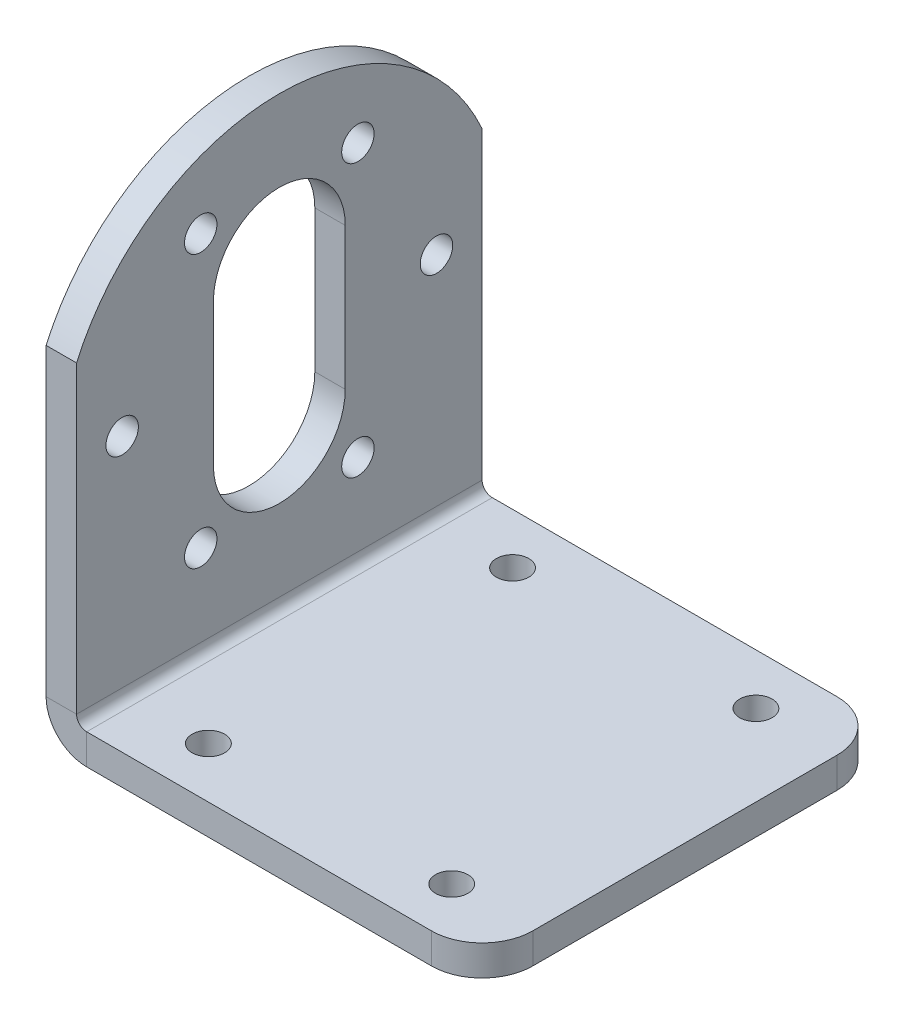
ISO-10303-21;
HEADER;
FILE_DESCRIPTION(('STEP AP214'),'2;1');
FILE_NAME('part.step','',(''),(''),'','','');
FILE_SCHEMA(('AUTOMOTIVE_DESIGN { 1 0 10303 214 1 1 1 1 }'));
ENDSEC;
DATA;
#1=APPLICATION_CONTEXT('core data for automotive mechanical design processes');
#2=APPLICATION_PROTOCOL_DEFINITION('international standard','automotive_design',2000,#1);
#3=PRODUCT_CONTEXT('',#1,'mechanical');
#4=PRODUCT('Part','Part','',(#3));
#5=PRODUCT_RELATED_PRODUCT_CATEGORY('part','',(#4));
#6=PRODUCT_DEFINITION_FORMATION('','',#4);
#7=PRODUCT_DEFINITION_CONTEXT('part definition',#1,'design');
#8=PRODUCT_DEFINITION('design','',#6,#7);
#9=PRODUCT_DEFINITION_SHAPE('','',#8);
#10=(LENGTH_UNIT() NAMED_UNIT(*) SI_UNIT(.MILLI.,.METRE.));
#11=(NAMED_UNIT(*) PLANE_ANGLE_UNIT() SI_UNIT($,.RADIAN.));
#12=(NAMED_UNIT(*) SI_UNIT($,.STERADIAN.) SOLID_ANGLE_UNIT());
#13=UNCERTAINTY_MEASURE_WITH_UNIT(LENGTH_MEASURE(1.E-05),#10,'distance_accuracy_value','');
#14=(GEOMETRIC_REPRESENTATION_CONTEXT(3) GLOBAL_UNCERTAINTY_ASSIGNED_CONTEXT((#13)) GLOBAL_UNIT_ASSIGNED_CONTEXT((#10,
#11,#12)) REPRESENTATION_CONTEXT('',''));
#15=CARTESIAN_POINT('',(0.,0.,0.));
#16=DIRECTION('',(0.,0.,1.));
#17=DIRECTION('',(1.,0.,0.));
#18=AXIS2_PLACEMENT_3D('',#15,#16,#17);
#19=CARTESIAN_POINT('',(7.99999999999999,44.,5.));
#20=DIRECTION('',(0.,-1.,0.));
#21=DIRECTION('',(0.,0.,-1.));
#22=AXIS2_PLACEMENT_3D('',#19,#20,#21);
#23=CYLINDRICAL_SURFACE('',#22,1.6);
#24=CARTESIAN_POINT('',(7.99999999999999,0.,5.));
#25=DIRECTION('',(0.,1.,0.));
#26=DIRECTION('',(0.,0.,1.));
#27=AXIS2_PLACEMENT_3D('',#24,#25,#26);
#28=CIRCLE('',#27,1.6);
#29=CARTESIAN_POINT('',(7.99999999999999,0.,6.6));
#30=VERTEX_POINT('',#29);
#31=EDGE_CURVE('E277',#30,#30,#28,.T.);
#32=ORIENTED_EDGE('',*,*,#31,.T.);
#33=EDGE_LOOP('',(#32));
#34=FACE_BOUND('',#33,.T.);
#35=CARTESIAN_POINT('',(7.99999999999999,-3.,5.));
#36=DIRECTION('',(0.,-1.,0.));
#37=DIRECTION('',(0.,0.,-1.));
#38=AXIS2_PLACEMENT_3D('',#35,#36,#37);
#39=CIRCLE('',#38,1.6);
#40=CARTESIAN_POINT('',(7.99999999999999,-3.,3.40000000000001));
#41=VERTEX_POINT('',#40);
#42=EDGE_CURVE('E280',#41,#41,#39,.T.);
#43=ORIENTED_EDGE('',*,*,#42,.T.);
#44=EDGE_LOOP('',(#43));
#45=FACE_BOUND('',#44,.T.);
#46=ADVANCED_FACE('F56',(#34,#45),#23,.F.);
#47=CARTESIAN_POINT('',(7.99999999999999,44.,35.));
#48=DIRECTION('',(0.,-1.,0.));
#49=DIRECTION('',(0.,0.,-1.));
#50=AXIS2_PLACEMENT_3D('',#47,#48,#49);
#51=CYLINDRICAL_SURFACE('',#50,1.6);
#52=CARTESIAN_POINT('',(7.99999999999999,0.,35.));
#53=DIRECTION('',(0.,1.,0.));
#54=DIRECTION('',(0.,0.,1.));
#55=AXIS2_PLACEMENT_3D('',#52,#53,#54);
#56=CIRCLE('',#55,1.6);
#57=CARTESIAN_POINT('',(7.99999999999999,0.,36.6));
#58=VERTEX_POINT('',#57);
#59=EDGE_CURVE('E266',#58,#58,#56,.T.);
#60=ORIENTED_EDGE('',*,*,#59,.T.);
#61=EDGE_LOOP('',(#60));
#62=FACE_BOUND('',#61,.T.);
#63=CARTESIAN_POINT('',(7.99999999999999,-3.,35.));
#64=DIRECTION('',(0.,-1.,0.));
#65=DIRECTION('',(0.,0.,-1.));
#66=AXIS2_PLACEMENT_3D('',#63,#64,#65);
#67=CIRCLE('',#66,1.6);
#68=CARTESIAN_POINT('',(7.99999999999999,-3.,33.4));
#69=VERTEX_POINT('',#68);
#70=EDGE_CURVE('E274',#69,#69,#67,.T.);
#71=ORIENTED_EDGE('',*,*,#70,.T.);
#72=EDGE_LOOP('',(#71));
#73=FACE_BOUND('',#72,.T.);
#74=ADVANCED_FACE('F362',(#62,#73),#51,.F.);
#75=CARTESIAN_POINT('',(0.,0.,40.));
#76=DIRECTION('',(1.,0.,0.));
#77=DIRECTION('',(0.,0.,-1.));
#78=AXIS2_PLACEMENT_3D('',#75,#76,#77);
#79=PLANE('',#78);
#80=CARTESIAN_POINT('',(0.,22.5,4.5));
#81=DIRECTION('',(1.,0.,0.));
#82=DIRECTION('',(0.,0.,-1.));
#83=AXIS2_PLACEMENT_3D('',#80,#81,#82);
#84=CIRCLE('',#83,1.6);
#85=CARTESIAN_POINT('',(0.,22.5,2.9));
#86=VERTEX_POINT('',#85);
#87=EDGE_CURVE('E679',#86,#86,#84,.T.);
#88=ORIENTED_EDGE('',*,*,#87,.F.);
#89=EDGE_LOOP('',(#88));
#90=FACE_BOUND('',#89,.T.);
#91=CARTESIAN_POINT('',(0.,35.9233937586588,12.25));
#92=DIRECTION('',(1.,0.,0.));
#93=DIRECTION('',(0.,0.,-1.));
#94=AXIS2_PLACEMENT_3D('',#91,#92,#93);
#95=CIRCLE('',#94,1.59999999999995);
#96=CARTESIAN_POINT('',(0.,35.9233937586588,10.6500000000001));
#97=VERTEX_POINT('',#96);
#98=EDGE_CURVE('E683',#97,#97,#95,.T.);
#99=ORIENTED_EDGE('',*,*,#98,.F.);
#100=EDGE_LOOP('',(#99));
#101=FACE_BOUND('',#100,.T.);
#102=CARTESIAN_POINT('',(0.,35.9233937586589,27.7499999999999));
#103=DIRECTION('',(1.,0.,0.));
#104=DIRECTION('',(0.,0.,-1.));
#105=AXIS2_PLACEMENT_3D('',#102,#103,#104);
#106=CIRCLE('',#105,1.6);
#107=CARTESIAN_POINT('',(0.,35.9233937586589,26.1499999999999));
#108=VERTEX_POINT('',#107);
#109=EDGE_CURVE('E687',#108,#108,#106,.T.);
#110=ORIENTED_EDGE('',*,*,#109,.F.);
#111=EDGE_LOOP('',(#110));
#112=FACE_BOUND('',#111,.T.);
#113=CARTESIAN_POINT('',(0.,22.5000000000001,35.5));
#114=DIRECTION('',(1.,0.,0.));
#115=DIRECTION('',(0.,0.,-1.));
#116=AXIS2_PLACEMENT_3D('',#113,#114,#115);
#117=CIRCLE('',#116,1.6);
#118=CARTESIAN_POINT('',(0.,22.5000000000001,33.9));
#119=VERTEX_POINT('',#118);
#120=EDGE_CURVE('E691',#119,#119,#117,.T.);
#121=ORIENTED_EDGE('',*,*,#120,.F.);
#122=EDGE_LOOP('',(#121));
#123=FACE_BOUND('',#122,.T.);
#124=CARTESIAN_POINT('',(0.,9.07660624134124,27.7500000000001));
#125=DIRECTION('',(1.,0.,0.));
#126=DIRECTION('',(0.,0.,-1.));
#127=AXIS2_PLACEMENT_3D('',#124,#125,#126);
#128=CIRCLE('',#127,1.6);
#129=CARTESIAN_POINT('',(0.,9.07660624134124,26.1500000000001));
#130=VERTEX_POINT('',#129);
#131=EDGE_CURVE('E695',#130,#130,#128,.T.);
#132=ORIENTED_EDGE('',*,*,#131,.F.);
#133=EDGE_LOOP('',(#132));
#134=FACE_BOUND('',#133,.T.);
#135=CARTESIAN_POINT('',(0.,9.07660624134118,12.25));
#136=DIRECTION('',(1.,0.,0.));
#137=DIRECTION('',(0.,0.,-1.));
#138=AXIS2_PLACEMENT_3D('',#135,#136,#137);
#139=CIRCLE('',#138,1.6);
#140=CARTESIAN_POINT('',(0.,9.07660624134118,10.65));
#141=VERTEX_POINT('',#140);
#142=EDGE_CURVE('E699',#141,#141,#139,.T.);
#143=ORIENTED_EDGE('',*,*,#142,.F.);
#144=EDGE_LOOP('',(#143));
#145=FACE_BOUND('',#144,.T.);
#146=CARTESIAN_POINT('',(0.,29.5,20.));
#147=DIRECTION('',(1.,0.,0.));
#148=DIRECTION('',(0.,0.,-1.));
#149=AXIS2_PLACEMENT_3D('',#146,#147,#148);
#150=CIRCLE('',#149,6.5);
#151=CARTESIAN_POINT('',(0.,29.5,13.5));
#152=VERTEX_POINT('',#151);
#153=CARTESIAN_POINT('',(0.,29.5,26.5));
#154=VERTEX_POINT('',#153);
#155=EDGE_CURVE('E199',#152,#154,#150,.T.);
#156=ORIENTED_EDGE('',*,*,#155,.F.);
#157=DIRECTION('',(0.,1.,0.));
#158=VECTOR('',#157,1.);
#159=CARTESIAN_POINT('',(0.,0.,13.5));
#160=LINE('',#159,#158);
#161=CARTESIAN_POINT('',(0.,15.5,13.5));
#162=VERTEX_POINT('',#161);
#163=EDGE_CURVE('E192',#162,#152,#160,.T.);
#164=ORIENTED_EDGE('',*,*,#163,.F.);
#165=CARTESIAN_POINT('',(0.,15.5,20.));
#166=DIRECTION('',(1.,0.,0.));
#167=DIRECTION('',(0.,0.,-1.));
#168=AXIS2_PLACEMENT_3D('',#165,#166,#167);
#169=CIRCLE('',#168,6.5);
#170=CARTESIAN_POINT('',(0.,15.5,26.5));
#171=VERTEX_POINT('',#170);
#172=EDGE_CURVE('E167',#171,#162,#169,.T.);
#173=ORIENTED_EDGE('',*,*,#172,.F.);
#174=DIRECTION('',(0.,-1.,0.));
#175=VECTOR('',#174,1.);
#176=CARTESIAN_POINT('',(0.,0.,26.5));
#177=LINE('',#176,#175);
#178=EDGE_CURVE('E197',#154,#171,#177,.T.);
#179=ORIENTED_EDGE('',*,*,#178,.F.);
#180=EDGE_LOOP('',(#156,#164,#173,#179));
#181=FACE_BOUND('',#180,.T.);
#182=CARTESIAN_POINT('',(0.,22.1134778286727,20.));
#183=DIRECTION('',(1.,0.,0.));
#184=DIRECTION('',(0.,0.,-1.));
#185=AXIS2_PLACEMENT_3D('',#182,#183,#184);
#186=CIRCLE('',#185,21.8865221713273);
#187=CARTESIAN_POINT('',(0.,31.0027889806126,40.));
#188=VERTEX_POINT('',#187);
#189=CARTESIAN_POINT('',(0.,31.0027889806126,0.));
#190=VERTEX_POINT('',#189);
#191=EDGE_CURVE('E205',#188,#190,#186,.F.);
#192=ORIENTED_EDGE('',*,*,#191,.F.);
#193=DIRECTION('',(0.,-1.,0.));
#194=VECTOR('',#193,1.);
#195=CARTESIAN_POINT('',(0.,0.,40.));
#196=LINE('',#195,#194);
#197=CARTESIAN_POINT('',(0.,1.,40.));
#198=VERTEX_POINT('',#197);
#199=EDGE_CURVE('E216',#188,#198,#196,.T.);
#200=ORIENTED_EDGE('',*,*,#199,.T.);
#201=DIRECTION('',(0.,0.,-1.));
#202=VECTOR('',#201,1.);
#203=CARTESIAN_POINT('',(0.,1.,40.));
#204=LINE('',#203,#202);
#205=CARTESIAN_POINT('',(0.,1.,0.));
#206=VERTEX_POINT('',#205);
#207=EDGE_CURVE('E243',#198,#206,#204,.T.);
#208=ORIENTED_EDGE('',*,*,#207,.T.);
#209=DIRECTION('',(0.,-1.,0.));
#210=VECTOR('',#209,1.);
#211=CARTESIAN_POINT('',(0.,0.,0.));
#212=LINE('',#211,#210);
#213=EDGE_CURVE('E232',#190,#206,#212,.T.);
#214=ORIENTED_EDGE('',*,*,#213,.F.);
#215=EDGE_LOOP('',(#192,#200,#208,#214));
#216=FACE_BOUND('',#215,.T.);
#217=ADVANCED_FACE('F336',(#90,#101,#112,#123,#134,#145,#181,#216),#79,.T.);
#218=CARTESIAN_POINT('',(-3.,0.,40.));
#219=DIRECTION('',(1.,0.,0.));
#220=DIRECTION('',(0.,0.,-1.));
#221=AXIS2_PLACEMENT_3D('',#218,#219,#220);
#222=PLANE('',#221);
#223=CARTESIAN_POINT('',(-3.,22.5,4.5));
#224=DIRECTION('',(-1.,0.,0.));
#225=DIRECTION('',(0.,0.,1.));
#226=AXIS2_PLACEMENT_3D('',#223,#224,#225);
#227=CIRCLE('',#226,1.6);
#228=CARTESIAN_POINT('',(-3.,22.5,6.1));
#229=VERTEX_POINT('',#228);
#230=EDGE_CURVE('E710',#229,#229,#227,.T.);
#231=ORIENTED_EDGE('',*,*,#230,.F.);
#232=EDGE_LOOP('',(#231));
#233=FACE_BOUND('',#232,.T.);
#234=CARTESIAN_POINT('',(-3.,35.9233937586588,12.25));
#235=DIRECTION('',(-1.,0.,0.));
#236=DIRECTION('',(0.,0.,1.));
#237=AXIS2_PLACEMENT_3D('',#234,#235,#236);
#238=CIRCLE('',#237,1.59999999999995);
#239=CARTESIAN_POINT('',(-3.,35.9233937586588,13.85));
#240=VERTEX_POINT('',#239);
#241=EDGE_CURVE('E270',#240,#240,#238,.T.);
#242=ORIENTED_EDGE('',*,*,#241,.F.);
#243=EDGE_LOOP('',(#242));
#244=FACE_BOUND('',#243,.T.);
#245=CARTESIAN_POINT('',(-3.,35.9233937586589,27.7499999999999));
#246=DIRECTION('',(-1.,0.,0.));
#247=DIRECTION('',(0.,0.,1.));
#248=AXIS2_PLACEMENT_3D('',#245,#246,#247);
#249=CIRCLE('',#248,1.6);
#250=CARTESIAN_POINT('',(-3.,35.9233937586589,29.3499999999999));
#251=VERTEX_POINT('',#250);
#252=EDGE_CURVE('E711',#251,#251,#249,.T.);
#253=ORIENTED_EDGE('',*,*,#252,.F.);
#254=EDGE_LOOP('',(#253));
#255=FACE_BOUND('',#254,.T.);
#256=CARTESIAN_POINT('',(-3.,22.5000000000001,35.5));
#257=DIRECTION('',(-1.,0.,0.));
#258=DIRECTION('',(0.,0.,1.));
#259=AXIS2_PLACEMENT_3D('',#256,#257,#258);
#260=CIRCLE('',#259,1.6);
#261=CARTESIAN_POINT('',(-3.,22.5000000000001,37.1));
#262=VERTEX_POINT('',#261);
#263=EDGE_CURVE('E714',#262,#262,#260,.T.);
#264=ORIENTED_EDGE('',*,*,#263,.F.);
#265=EDGE_LOOP('',(#264));
#266=FACE_BOUND('',#265,.T.);
#267=CARTESIAN_POINT('',(-3.,9.07660624134124,27.7500000000001));
#268=DIRECTION('',(-1.,0.,0.));
#269=DIRECTION('',(0.,0.,1.));
#270=AXIS2_PLACEMENT_3D('',#267,#268,#269);
#271=CIRCLE('',#270,1.6);
#272=CARTESIAN_POINT('',(-3.,9.07660624134124,29.3500000000001));
#273=VERTEX_POINT('',#272);
#274=EDGE_CURVE('E717',#273,#273,#271,.T.);
#275=ORIENTED_EDGE('',*,*,#274,.F.);
#276=EDGE_LOOP('',(#275));
#277=FACE_BOUND('',#276,.T.);
#278=CARTESIAN_POINT('',(-3.,9.07660624134118,12.25));
#279=DIRECTION('',(-1.,0.,0.));
#280=DIRECTION('',(0.,0.,1.));
#281=AXIS2_PLACEMENT_3D('',#278,#279,#280);
#282=CIRCLE('',#281,1.6);
#283=CARTESIAN_POINT('',(-3.,9.07660624134118,13.85));
#284=VERTEX_POINT('',#283);
#285=EDGE_CURVE('E720',#284,#284,#282,.T.);
#286=ORIENTED_EDGE('',*,*,#285,.F.);
#287=EDGE_LOOP('',(#286));
#288=FACE_BOUND('',#287,.T.);
#289=DIRECTION('',(0.,-1.,0.));
#290=VECTOR('',#289,1.);
#291=CARTESIAN_POINT('',(-3.,29.5,13.5));
#292=LINE('',#291,#290);
#293=CARTESIAN_POINT('',(-3.,29.5,13.5));
#294=VERTEX_POINT('',#293);
#295=CARTESIAN_POINT('',(-3.,15.5,13.5));
#296=VERTEX_POINT('',#295);
#297=EDGE_CURVE('E175',#294,#296,#292,.T.);
#298=ORIENTED_EDGE('',*,*,#297,.F.);
#299=CARTESIAN_POINT('',(-3.,29.5,20.));
#300=DIRECTION('',(-1.,0.,0.));
#301=DIRECTION('',(0.,0.,1.));
#302=AXIS2_PLACEMENT_3D('',#299,#300,#301);
#303=CIRCLE('',#302,6.5);
#304=CARTESIAN_POINT('',(-3.,29.5,26.5));
#305=VERTEX_POINT('',#304);
#306=EDGE_CURVE('E180',#305,#294,#303,.T.);
#307=ORIENTED_EDGE('',*,*,#306,.F.);
#308=DIRECTION('',(0.,1.,0.));
#309=VECTOR('',#308,1.);
#310=CARTESIAN_POINT('',(-3.,29.5,26.5));
#311=LINE('',#310,#309);
#312=CARTESIAN_POINT('',(-3.,15.5,26.5));
#313=VERTEX_POINT('',#312);
#314=EDGE_CURVE('E185',#313,#305,#311,.T.);
#315=ORIENTED_EDGE('',*,*,#314,.F.);
#316=CARTESIAN_POINT('',(-3.,15.5,20.));
#317=DIRECTION('',(-1.,0.,0.));
#318=DIRECTION('',(0.,0.,1.));
#319=AXIS2_PLACEMENT_3D('',#316,#317,#318);
#320=CIRCLE('',#319,6.5);
#321=EDGE_CURVE('E164',#296,#313,#320,.T.);
#322=ORIENTED_EDGE('',*,*,#321,.F.);
#323=EDGE_LOOP('',(#298,#307,#315,#322));
#324=FACE_BOUND('',#323,.T.);
#325=DIRECTION('',(0.,1.,0.));
#326=VECTOR('',#325,1.);
#327=CARTESIAN_POINT('',(-3.,0.,40.));
#328=LINE('',#327,#326);
#329=CARTESIAN_POINT('',(-3.,31.0027889806126,40.));
#330=VERTEX_POINT('',#329);
#331=CARTESIAN_POINT('',(-3.,1.,40.));
#332=VERTEX_POINT('',#331);
#333=EDGE_CURVE('E218',#330,#332,#328,.F.);
#334=ORIENTED_EDGE('',*,*,#333,.F.);
#335=CARTESIAN_POINT('',(-3.,22.1134778286727,20.));
#336=DIRECTION('',(-1.,0.,0.));
#337=DIRECTION('',(0.,0.,1.));
#338=AXIS2_PLACEMENT_3D('',#335,#336,#337);
#339=CIRCLE('',#338,21.8865221713273);
#340=CARTESIAN_POINT('',(-3.,31.0027889806126,0.));
#341=VERTEX_POINT('',#340);
#342=EDGE_CURVE('E201',#341,#330,#339,.F.);
#343=ORIENTED_EDGE('',*,*,#342,.F.);
#344=DIRECTION('',(0.,1.,0.));
#345=VECTOR('',#344,1.);
#346=CARTESIAN_POINT('',(-3.,0.,0.));
#347=LINE('',#346,#345);
#348=CARTESIAN_POINT('',(-3.,1.,0.));
#349=VERTEX_POINT('',#348);
#350=EDGE_CURVE('E234',#341,#349,#347,.F.);
#351=ORIENTED_EDGE('',*,*,#350,.T.);
#352=DIRECTION('',(0.,0.,-1.));
#353=VECTOR('',#352,1.);
#354=CARTESIAN_POINT('',(-3.,1.,40.));
#355=LINE('',#354,#353);
#356=EDGE_CURVE('E240',#332,#349,#355,.T.);
#357=ORIENTED_EDGE('',*,*,#356,.F.);
#358=EDGE_LOOP('',(#334,#343,#351,#357));
#359=FACE_BOUND('',#358,.T.);
#360=ADVANCED_FACE('F182',(#233,#244,#255,#266,#277,#288,#324,#359),#222,.F.);
#361=CARTESIAN_POINT('',(1.,0.,40.));
#362=DIRECTION('',(0.,0.,1.));
#363=DIRECTION('',(1.,0.,0.));
#364=AXIS2_PLACEMENT_3D('',#361,#362,#363);
#365=PLANE('',#364);
#366=DIRECTION('',(0.,-1.,0.));
#367=VECTOR('',#366,1.);
#368=CARTESIAN_POINT('',(1.,0.,40.));
#369=LINE('',#368,#367);
#370=CARTESIAN_POINT('',(1.,0.,40.));
#371=VERTEX_POINT('',#370);
#372=CARTESIAN_POINT('',(1.,-3.,40.));
#373=VERTEX_POINT('',#372);
#374=EDGE_CURVE('E261',#371,#373,#369,.T.);
#375=ORIENTED_EDGE('',*,*,#374,.F.);
#376=CARTESIAN_POINT('',(1.,1.,40.));
#377=DIRECTION('',(0.,0.,-1.));
#378=DIRECTION('',(-1.,0.,0.));
#379=AXIS2_PLACEMENT_3D('',#376,#377,#378);
#380=CIRCLE('',#379,1.);
#381=EDGE_CURVE('E213',#198,#371,#380,.F.);
#382=ORIENTED_EDGE('',*,*,#381,.F.);
#383=DIRECTION('',(1.,0.,0.));
#384=VECTOR('',#383,1.);
#385=CARTESIAN_POINT('',(-3.,1.,40.));
#386=LINE('',#385,#384);
#387=EDGE_CURVE('E258',#332,#198,#386,.T.);
#388=ORIENTED_EDGE('',*,*,#387,.F.);
#389=CARTESIAN_POINT('',(1.,1.,40.));
#390=DIRECTION('',(0.,0.,1.));
#391=DIRECTION('',(1.,0.,0.));
#392=AXIS2_PLACEMENT_3D('',#389,#390,#391);
#393=CIRCLE('',#392,4.);
#394=EDGE_CURVE('E220',#332,#373,#393,.T.);
#395=ORIENTED_EDGE('',*,*,#394,.T.);
#396=EDGE_LOOP('',(#375,#382,#388,#395));
#397=FACE_BOUND('',#396,.T.);
#398=ADVANCED_FACE('F322',(#397),#365,.T.);
#399=CARTESIAN_POINT('',(-3.,1.,40.));
#400=DIRECTION('',(0.,0.,1.));
#401=DIRECTION('',(1.,0.,0.));
#402=AXIS2_PLACEMENT_3D('',#399,#400,#401);
#403=PLANE('',#402);
#404=DIRECTION('',(1.,0.,0.));
#405=VECTOR('',#404,1.);
#406=CARTESIAN_POINT('',(0.,-3.,40.));
#407=LINE('',#406,#405);
#408=CARTESIAN_POINT('',(35.,-3.,40.));
#409=VERTEX_POINT('',#408);
#410=EDGE_CURVE('E208',#373,#409,#407,.T.);
#411=ORIENTED_EDGE('',*,*,#410,.T.);
#412=DIRECTION('',(0.,-1.,0.));
#413=VECTOR('',#412,1.);
#414=CARTESIAN_POINT('',(35.,1.,40.));
#415=LINE('',#414,#413);
#416=CARTESIAN_POINT('',(35.,0.,40.));
#417=VERTEX_POINT('',#416);
#418=EDGE_CURVE('E12',#409,#417,#415,.F.);
#419=ORIENTED_EDGE('',*,*,#418,.T.);
#420=DIRECTION('',(1.,0.,0.));
#421=VECTOR('',#420,1.);
#422=CARTESIAN_POINT('',(0.,0.,40.));
#423=LINE('',#422,#421);
#424=EDGE_CURVE('E210',#371,#417,#423,.T.);
#425=ORIENTED_EDGE('',*,*,#424,.F.);
#426=ORIENTED_EDGE('',*,*,#374,.T.);
#427=EDGE_LOOP('',(#411,#419,#425,#426));
#428=FACE_BOUND('',#427,.T.);
#429=ADVANCED_FACE('F316',(#428),#403,.T.);
#430=CARTESIAN_POINT('',(0.,1.,0.));
#431=DIRECTION('',(0.,0.,-1.));
#432=DIRECTION('',(-1.,0.,0.));
#433=AXIS2_PLACEMENT_3D('',#430,#431,#432);
#434=PLANE('',#433);
#435=DIRECTION('',(-1.,0.,0.));
#436=VECTOR('',#435,1.);
#437=CARTESIAN_POINT('',(0.,1.,0.));
#438=LINE('',#437,#436);
#439=EDGE_CURVE('E255',#206,#349,#438,.T.);
#440=ORIENTED_EDGE('',*,*,#439,.F.);
#441=CARTESIAN_POINT('',(1.,1.,0.));
#442=DIRECTION('',(0.,0.,-1.));
#443=DIRECTION('',(-1.,0.,0.));
#444=AXIS2_PLACEMENT_3D('',#441,#442,#443);
#445=CIRCLE('',#444,1.);
#446=CARTESIAN_POINT('',(1.,0.,0.));
#447=VERTEX_POINT('',#446);
#448=EDGE_CURVE('E229',#206,#447,#445,.F.);
#449=ORIENTED_EDGE('',*,*,#448,.T.);
#450=DIRECTION('',(0.,1.,0.));
#451=VECTOR('',#450,1.);
#452=CARTESIAN_POINT('',(1.,-3.,0.));
#453=LINE('',#452,#451);
#454=CARTESIAN_POINT('',(1.,-3.,0.));
#455=VERTEX_POINT('',#454);
#456=EDGE_CURVE('E253',#455,#447,#453,.T.);
#457=ORIENTED_EDGE('',*,*,#456,.F.);
#458=CARTESIAN_POINT('',(1.,1.,0.));
#459=DIRECTION('',(0.,0.,1.));
#460=DIRECTION('',(1.,0.,0.));
#461=AXIS2_PLACEMENT_3D('',#458,#459,#460);
#462=CIRCLE('',#461,4.);
#463=EDGE_CURVE('E211',#349,#455,#462,.T.);
#464=ORIENTED_EDGE('',*,*,#463,.F.);
#465=EDGE_LOOP('',(#440,#449,#457,#464));
#466=FACE_BOUND('',#465,.T.);
#467=ADVANCED_FACE('F329',(#466),#434,.T.);
#468=CARTESIAN_POINT('',(1.,-3.,0.));
#469=DIRECTION('',(0.,0.,-1.));
#470=DIRECTION('',(-1.,0.,0.));
#471=AXIS2_PLACEMENT_3D('',#468,#469,#470);
#472=PLANE('',#471);
#473=DIRECTION('',(-1.,0.,0.));
#474=VECTOR('',#473,1.);
#475=CARTESIAN_POINT('',(7.,31.0027889806126,0.));
#476=LINE('',#475,#474);
#477=EDGE_CURVE('E203',#190,#341,#476,.T.);
#478=ORIENTED_EDGE('',*,*,#477,.F.);
#479=ORIENTED_EDGE('',*,*,#213,.T.);
#480=ORIENTED_EDGE('',*,*,#439,.T.);
#481=ORIENTED_EDGE('',*,*,#350,.F.);
#482=EDGE_LOOP('',(#478,#479,#480,#481));
#483=FACE_BOUND('',#482,.T.);
#484=ADVANCED_FACE('F346',(#483),#472,.T.);
#485=CARTESIAN_POINT('',(0.,-3.,40.));
#486=DIRECTION('',(0.,1.,0.));
#487=DIRECTION('',(0.,0.,1.));
#488=AXIS2_PLACEMENT_3D('',#485,#486,#487);
#489=PLANE('',#488);
#490=CARTESIAN_POINT('',(32.,-3.,5.));
#491=DIRECTION('',(0.,-1.,0.));
#492=DIRECTION('',(0.,0.,-1.));
#493=AXIS2_PLACEMENT_3D('',#490,#491,#492);
#494=CIRCLE('',#493,1.6);
#495=CARTESIAN_POINT('',(32.,-3.,3.40000000000001));
#496=VERTEX_POINT('',#495);
#497=EDGE_CURVE('E729',#496,#496,#494,.T.);
#498=ORIENTED_EDGE('',*,*,#497,.F.);
#499=EDGE_LOOP('',(#498));
#500=FACE_BOUND('',#499,.T.);
#501=CARTESIAN_POINT('',(32.,-3.,35.));
#502=DIRECTION('',(0.,-1.,0.));
#503=DIRECTION('',(0.,0.,-1.));
#504=AXIS2_PLACEMENT_3D('',#501,#502,#503);
#505=CIRCLE('',#504,1.6);
#506=CARTESIAN_POINT('',(32.,-3.,33.4));
#507=VERTEX_POINT('',#506);
#508=EDGE_CURVE('E271',#507,#507,#505,.T.);
#509=ORIENTED_EDGE('',*,*,#508,.F.);
#510=EDGE_LOOP('',(#509));
#511=FACE_BOUND('',#510,.T.);
#512=DIRECTION('',(1.,0.,0.));
#513=VECTOR('',#512,1.);
#514=CARTESIAN_POINT('',(0.,-3.,0.));
#515=LINE('',#514,#513);
#516=CARTESIAN_POINT('',(35.,-3.,0.));
#517=VERTEX_POINT('',#516);
#518=EDGE_CURVE('E207',#455,#517,#515,.T.);
#519=ORIENTED_EDGE('',*,*,#518,.T.);
#520=CARTESIAN_POINT('',(35.,-3.,5.));
#521=DIRECTION('',(0.,1.,0.));
#522=DIRECTION('',(0.,0.,1.));
#523=AXIS2_PLACEMENT_3D('',#520,#521,#522);
#524=CIRCLE('',#523,5.);
#525=CARTESIAN_POINT('',(40.,-3.,5.));
#526=VERTEX_POINT('',#525);
#527=EDGE_CURVE('E288',#517,#526,#524,.F.);
#528=ORIENTED_EDGE('',*,*,#527,.T.);
#529=DIRECTION('',(0.,0.,-1.));
#530=VECTOR('',#529,1.);
#531=CARTESIAN_POINT('',(40.,-3.,40.));
#532=LINE('',#531,#530);
#533=CARTESIAN_POINT('',(40.,-3.,35.));
#534=VERTEX_POINT('',#533);
#535=EDGE_CURVE('E251',#534,#526,#532,.T.);
#536=ORIENTED_EDGE('',*,*,#535,.F.);
#537=CARTESIAN_POINT('',(35.,-3.,35.));
#538=DIRECTION('',(0.,1.,0.));
#539=DIRECTION('',(0.,0.,1.));
#540=AXIS2_PLACEMENT_3D('',#537,#538,#539);
#541=CIRCLE('',#540,5.);
#542=EDGE_CURVE('E286',#534,#409,#541,.F.);
#543=ORIENTED_EDGE('',*,*,#542,.T.);
#544=ORIENTED_EDGE('',*,*,#410,.F.);
#545=DIRECTION('',(0.,0.,-1.));
#546=VECTOR('',#545,1.);
#547=CARTESIAN_POINT('',(1.,-3.,40.));
#548=LINE('',#547,#546);
#549=EDGE_CURVE('E223',#373,#455,#548,.T.);
#550=ORIENTED_EDGE('',*,*,#549,.T.);
#551=EDGE_LOOP('',(#519,#528,#536,#543,#544,#550));
#552=FACE_BOUND('',#551,.T.);
#553=ORIENTED_EDGE('',*,*,#70,.F.);
#554=EDGE_LOOP('',(#553));
#555=FACE_BOUND('',#554,.T.);
#556=ORIENTED_EDGE('',*,*,#42,.F.);
#557=EDGE_LOOP('',(#556));
#558=FACE_BOUND('',#557,.T.);
#559=ADVANCED_FACE('F309',(#500,#511,#552,#555,#558),#489,.F.);
#560=CARTESIAN_POINT('',(40.,0.,40.));
#561=DIRECTION('',(1.,0.,0.));
#562=DIRECTION('',(0.,0.,-1.));
#563=AXIS2_PLACEMENT_3D('',#560,#561,#562);
#564=PLANE('',#563);
#565=ORIENTED_EDGE('',*,*,#535,.T.);
#566=DIRECTION('',(0.,-1.,0.));
#567=VECTOR('',#566,1.);
#568=CARTESIAN_POINT('',(40.,0.,5.));
#569=LINE('',#568,#567);
#570=CARTESIAN_POINT('',(40.,0.,5.));
#571=VERTEX_POINT('',#570);
#572=EDGE_CURVE('E77',#526,#571,#569,.F.);
#573=ORIENTED_EDGE('',*,*,#572,.T.);
#574=DIRECTION('',(0.,0.,-1.));
#575=VECTOR('',#574,1.);
#576=CARTESIAN_POINT('',(40.,0.,40.));
#577=LINE('',#576,#575);
#578=CARTESIAN_POINT('',(40.,0.,35.));
#579=VERTEX_POINT('',#578);
#580=EDGE_CURVE('E249',#579,#571,#577,.T.);
#581=ORIENTED_EDGE('',*,*,#580,.F.);
#582=DIRECTION('',(0.,-1.,0.));
#583=VECTOR('',#582,1.);
#584=CARTESIAN_POINT('',(40.,0.,35.));
#585=LINE('',#584,#583);
#586=EDGE_CURVE('E290',#579,#534,#585,.T.);
#587=ORIENTED_EDGE('',*,*,#586,.T.);
#588=EDGE_LOOP('',(#565,#573,#581,#587));
#589=FACE_BOUND('',#588,.T.);
#590=ADVANCED_FACE('F311',(#589),#564,.T.);
#591=CARTESIAN_POINT('',(0.,0.,40.));
#592=DIRECTION('',(0.,1.,0.));
#593=DIRECTION('',(0.,0.,1.));
#594=AXIS2_PLACEMENT_3D('',#591,#592,#593);
#595=PLANE('',#594);
#596=CARTESIAN_POINT('',(32.,0.,5.));
#597=DIRECTION('',(0.,1.,0.));
#598=DIRECTION('',(0.,0.,1.));
#599=AXIS2_PLACEMENT_3D('',#596,#597,#598);
#600=CIRCLE('',#599,1.6);
#601=CARTESIAN_POINT('',(32.,0.,6.6));
#602=VERTEX_POINT('',#601);
#603=EDGE_CURVE('E732',#602,#602,#600,.T.);
#604=ORIENTED_EDGE('',*,*,#603,.F.);
#605=EDGE_LOOP('',(#604));
#606=FACE_BOUND('',#605,.T.);
#607=CARTESIAN_POINT('',(32.,0.,35.));
#608=DIRECTION('',(0.,1.,0.));
#609=DIRECTION('',(0.,0.,1.));
#610=AXIS2_PLACEMENT_3D('',#607,#608,#609);
#611=CIRCLE('',#610,1.6);
#612=CARTESIAN_POINT('',(32.,0.,36.6));
#613=VERTEX_POINT('',#612);
#614=EDGE_CURVE('E267',#613,#613,#611,.T.);
#615=ORIENTED_EDGE('',*,*,#614,.F.);
#616=EDGE_LOOP('',(#615));
#617=FACE_BOUND('',#616,.T.);
#618=ORIENTED_EDGE('',*,*,#580,.T.);
#619=CARTESIAN_POINT('',(35.,0.,5.));
#620=DIRECTION('',(0.,1.,0.));
#621=DIRECTION('',(0.,0.,1.));
#622=AXIS2_PLACEMENT_3D('',#619,#620,#621);
#623=CIRCLE('',#622,5.);
#624=CARTESIAN_POINT('',(35.,0.,0.));
#625=VERTEX_POINT('',#624);
#626=EDGE_CURVE('E64',#571,#625,#623,.T.);
#627=ORIENTED_EDGE('',*,*,#626,.T.);
#628=DIRECTION('',(1.,0.,0.));
#629=VECTOR('',#628,1.);
#630=CARTESIAN_POINT('',(0.,0.,0.));
#631=LINE('',#630,#629);
#632=EDGE_CURVE('E226',#447,#625,#631,.T.);
#633=ORIENTED_EDGE('',*,*,#632,.F.);
#634=DIRECTION('',(0.,0.,-1.));
#635=VECTOR('',#634,1.);
#636=CARTESIAN_POINT('',(1.,0.,40.));
#637=LINE('',#636,#635);
#638=EDGE_CURVE('E246',#371,#447,#637,.T.);
#639=ORIENTED_EDGE('',*,*,#638,.F.);
#640=ORIENTED_EDGE('',*,*,#424,.T.);
#641=CARTESIAN_POINT('',(35.,0.,35.));
#642=DIRECTION('',(0.,1.,0.));
#643=DIRECTION('',(0.,0.,1.));
#644=AXIS2_PLACEMENT_3D('',#641,#642,#643);
#645=CIRCLE('',#644,5.);
#646=EDGE_CURVE('E294',#417,#579,#645,.T.);
#647=ORIENTED_EDGE('',*,*,#646,.T.);
#648=EDGE_LOOP('',(#618,#627,#633,#639,#640,#647));
#649=FACE_BOUND('',#648,.T.);
#650=ORIENTED_EDGE('',*,*,#59,.F.);
#651=EDGE_LOOP('',(#650));
#652=FACE_BOUND('',#651,.T.);
#653=ORIENTED_EDGE('',*,*,#31,.F.);
#654=EDGE_LOOP('',(#653));
#655=FACE_BOUND('',#654,.T.);
#656=ADVANCED_FACE('F298',(#606,#617,#649,#652,#655),#595,.T.);
#657=CARTESIAN_POINT('',(1.,1.,40.));
#658=DIRECTION('',(0.,0.,-1.));
#659=DIRECTION('',(-1.,0.,0.));
#660=AXIS2_PLACEMENT_3D('',#657,#658,#659);
#661=CYLINDRICAL_SURFACE('',#660,1.);
#662=ORIENTED_EDGE('',*,*,#448,.F.);
#663=ORIENTED_EDGE('',*,*,#207,.F.);
#664=ORIENTED_EDGE('',*,*,#381,.T.);
#665=ORIENTED_EDGE('',*,*,#638,.T.);
#666=EDGE_LOOP('',(#662,#663,#664,#665));
#667=FACE_BOUND('',#666,.T.);
#668=ADVANCED_FACE('F333',(#667),#661,.F.);
#669=CARTESIAN_POINT('',(1.,1.,40.));
#670=DIRECTION('',(0.,0.,-1.));
#671=DIRECTION('',(-1.,0.,0.));
#672=AXIS2_PLACEMENT_3D('',#669,#670,#671);
#673=CYLINDRICAL_SURFACE('',#672,4.);
#674=ORIENTED_EDGE('',*,*,#463,.T.);
#675=ORIENTED_EDGE('',*,*,#549,.F.);
#676=ORIENTED_EDGE('',*,*,#394,.F.);
#677=ORIENTED_EDGE('',*,*,#356,.T.);
#678=EDGE_LOOP('',(#674,#675,#676,#677));
#679=FACE_BOUND('',#678,.T.);
#680=ADVANCED_FACE('F325',(#679),#673,.T.);
#681=CARTESIAN_POINT('',(1.,1.,40.));
#682=DIRECTION('',(0.,0.,-1.));
#683=DIRECTION('',(-1.,0.,0.));
#684=AXIS2_PLACEMENT_3D('',#681,#682,#683);
#685=PLANE('',#684);
#686=ORIENTED_EDGE('',*,*,#199,.F.);
#687=DIRECTION('',(-1.,0.,0.));
#688=VECTOR('',#687,1.);
#689=CARTESIAN_POINT('',(7.,31.0027889806126,40.));
#690=LINE('',#689,#688);
#691=EDGE_CURVE('E263',#188,#330,#690,.T.);
#692=ORIENTED_EDGE('',*,*,#691,.T.);
#693=ORIENTED_EDGE('',*,*,#333,.T.);
#694=ORIENTED_EDGE('',*,*,#387,.T.);
#695=EDGE_LOOP('',(#686,#692,#693,#694));
#696=FACE_BOUND('',#695,.T.);
#697=ADVANCED_FACE('F340',(#696),#685,.F.);
#698=CARTESIAN_POINT('',(1.,1.,0.));
#699=DIRECTION('',(0.,0.,-1.));
#700=DIRECTION('',(-1.,0.,0.));
#701=AXIS2_PLACEMENT_3D('',#698,#699,#700);
#702=PLANE('',#701);
#703=ORIENTED_EDGE('',*,*,#632,.T.);
#704=DIRECTION('',(0.,-1.,0.));
#705=VECTOR('',#704,1.);
#706=CARTESIAN_POINT('',(35.,1.,0.));
#707=LINE('',#706,#705);
#708=EDGE_CURVE('E283',#625,#517,#707,.T.);
#709=ORIENTED_EDGE('',*,*,#708,.T.);
#710=ORIENTED_EDGE('',*,*,#518,.F.);
#711=ORIENTED_EDGE('',*,*,#456,.T.);
#712=EDGE_LOOP('',(#703,#709,#710,#711));
#713=FACE_BOUND('',#712,.T.);
#714=ADVANCED_FACE('F304',(#713),#702,.T.);
#715=CARTESIAN_POINT('',(7.,22.1134778286727,20.));
#716=DIRECTION('',(-1.,0.,0.));
#717=DIRECTION('',(0.,0.,1.));
#718=AXIS2_PLACEMENT_3D('',#715,#716,#717);
#719=CYLINDRICAL_SURFACE('',#718,21.8865221713273);
#720=ORIENTED_EDGE('',*,*,#191,.T.);
#721=ORIENTED_EDGE('',*,*,#477,.T.);
#722=ORIENTED_EDGE('',*,*,#342,.T.);
#723=ORIENTED_EDGE('',*,*,#691,.F.);
#724=EDGE_LOOP('',(#720,#721,#722,#723));
#725=FACE_BOUND('',#724,.T.);
#726=ADVANCED_FACE('F348',(#725),#719,.T.);
#727=CARTESIAN_POINT('',(40.,29.5,20.));
#728=DIRECTION('',(-1.,0.,0.));
#729=DIRECTION('',(0.,0.,1.));
#730=AXIS2_PLACEMENT_3D('',#727,#728,#729);
#731=CYLINDRICAL_SURFACE('',#730,6.5);
#732=ORIENTED_EDGE('',*,*,#155,.T.);
#733=DIRECTION('',(-1.,0.,0.));
#734=VECTOR('',#733,1.);
#735=CARTESIAN_POINT('',(40.,29.5,26.5));
#736=LINE('',#735,#734);
#737=EDGE_CURVE('E190',#154,#305,#736,.T.);
#738=ORIENTED_EDGE('',*,*,#737,.T.);
#739=ORIENTED_EDGE('',*,*,#306,.T.);
#740=DIRECTION('',(-1.,0.,0.));
#741=VECTOR('',#740,1.);
#742=CARTESIAN_POINT('',(40.,29.5,13.5));
#743=LINE('',#742,#741);
#744=EDGE_CURVE('E171',#152,#294,#743,.T.);
#745=ORIENTED_EDGE('',*,*,#744,.F.);
#746=EDGE_LOOP('',(#732,#738,#739,#745));
#747=FACE_BOUND('',#746,.T.);
#748=ADVANCED_FACE('F350',(#747),#731,.F.);
#749=CARTESIAN_POINT('',(40.,29.5,26.5));
#750=DIRECTION('',(0.,0.,1.));
#751=DIRECTION('',(1.,0.,0.));
#752=AXIS2_PLACEMENT_3D('',#749,#750,#751);
#753=PLANE('',#752);
#754=ORIENTED_EDGE('',*,*,#178,.T.);
#755=DIRECTION('',(-1.,0.,0.));
#756=VECTOR('',#755,1.);
#757=CARTESIAN_POINT('',(40.,15.5,26.5));
#758=LINE('',#757,#756);
#759=EDGE_CURVE('E170',#171,#313,#758,.T.);
#760=ORIENTED_EDGE('',*,*,#759,.T.);
#761=ORIENTED_EDGE('',*,*,#314,.T.);
#762=ORIENTED_EDGE('',*,*,#737,.F.);
#763=EDGE_LOOP('',(#754,#760,#761,#762));
#764=FACE_BOUND('',#763,.T.);
#765=ADVANCED_FACE('F356',(#764),#753,.F.);
#766=CARTESIAN_POINT('',(40.,15.5,20.));
#767=DIRECTION('',(-1.,0.,0.));
#768=DIRECTION('',(0.,0.,1.));
#769=AXIS2_PLACEMENT_3D('',#766,#767,#768);
#770=CYLINDRICAL_SURFACE('',#769,6.5);
#771=ORIENTED_EDGE('',*,*,#172,.T.);
#772=DIRECTION('',(-1.,0.,0.));
#773=VECTOR('',#772,1.);
#774=CARTESIAN_POINT('',(40.,15.5,13.5));
#775=LINE('',#774,#773);
#776=EDGE_CURVE('E159',#162,#296,#775,.T.);
#777=ORIENTED_EDGE('',*,*,#776,.T.);
#778=ORIENTED_EDGE('',*,*,#321,.T.);
#779=ORIENTED_EDGE('',*,*,#759,.F.);
#780=EDGE_LOOP('',(#771,#777,#778,#779));
#781=FACE_BOUND('',#780,.T.);
#782=ADVANCED_FACE('F161',(#781),#770,.F.);
#783=CARTESIAN_POINT('',(40.,29.5,13.5));
#784=DIRECTION('',(0.,0.,-1.));
#785=DIRECTION('',(0.,1.,0.));
#786=AXIS2_PLACEMENT_3D('',#783,#784,#785);
#787=PLANE('',#786);
#788=ORIENTED_EDGE('',*,*,#163,.T.);
#789=ORIENTED_EDGE('',*,*,#744,.T.);
#790=ORIENTED_EDGE('',*,*,#297,.T.);
#791=ORIENTED_EDGE('',*,*,#776,.F.);
#792=EDGE_LOOP('',(#788,#789,#790,#791));
#793=FACE_BOUND('',#792,.T.);
#794=ADVANCED_FACE('F176',(#793),#787,.F.);
#795=CARTESIAN_POINT('',(40.,9.07660624134118,12.25));
#796=DIRECTION('',(-1.,0.,0.));
#797=DIRECTION('',(0.,0.,1.));
#798=AXIS2_PLACEMENT_3D('',#795,#796,#797);
#799=CYLINDRICAL_SURFACE('',#798,1.6);
#800=ORIENTED_EDGE('',*,*,#142,.T.);
#801=EDGE_LOOP('',(#800));
#802=FACE_BOUND('',#801,.T.);
#803=ORIENTED_EDGE('',*,*,#285,.T.);
#804=EDGE_LOOP('',(#803));
#805=FACE_BOUND('',#804,.T.);
#806=ADVANCED_FACE('F398',(#802,#805),#799,.F.);
#807=CARTESIAN_POINT('',(40.,9.07660624134124,27.7500000000001));
#808=DIRECTION('',(-1.,0.,0.));
#809=DIRECTION('',(0.,0.,1.));
#810=AXIS2_PLACEMENT_3D('',#807,#808,#809);
#811=CYLINDRICAL_SURFACE('',#810,1.6);
#812=ORIENTED_EDGE('',*,*,#131,.T.);
#813=EDGE_LOOP('',(#812));
#814=FACE_BOUND('',#813,.T.);
#815=ORIENTED_EDGE('',*,*,#274,.T.);
#816=EDGE_LOOP('',(#815));
#817=FACE_BOUND('',#816,.T.);
#818=ADVANCED_FACE('F401',(#814,#817),#811,.F.);
#819=CARTESIAN_POINT('',(40.,22.5000000000001,35.5));
#820=DIRECTION('',(-1.,0.,0.));
#821=DIRECTION('',(0.,0.,1.));
#822=AXIS2_PLACEMENT_3D('',#819,#820,#821);
#823=CYLINDRICAL_SURFACE('',#822,1.6);
#824=ORIENTED_EDGE('',*,*,#120,.T.);
#825=EDGE_LOOP('',(#824));
#826=FACE_BOUND('',#825,.T.);
#827=ORIENTED_EDGE('',*,*,#263,.T.);
#828=EDGE_LOOP('',(#827));
#829=FACE_BOUND('',#828,.T.);
#830=ADVANCED_FACE('F405',(#826,#829),#823,.F.);
#831=CARTESIAN_POINT('',(40.,35.9233937586589,27.7499999999999));
#832=DIRECTION('',(-1.,0.,0.));
#833=DIRECTION('',(0.,0.,1.));
#834=AXIS2_PLACEMENT_3D('',#831,#832,#833);
#835=CYLINDRICAL_SURFACE('',#834,1.6);
#836=ORIENTED_EDGE('',*,*,#109,.T.);
#837=EDGE_LOOP('',(#836));
#838=FACE_BOUND('',#837,.T.);
#839=ORIENTED_EDGE('',*,*,#252,.T.);
#840=EDGE_LOOP('',(#839));
#841=FACE_BOUND('',#840,.T.);
#842=ADVANCED_FACE('F396',(#838,#841),#835,.F.);
#843=CARTESIAN_POINT('',(40.,35.9233937586588,12.25));
#844=DIRECTION('',(-1.,0.,0.));
#845=DIRECTION('',(0.,0.,1.));
#846=AXIS2_PLACEMENT_3D('',#843,#844,#845);
#847=CYLINDRICAL_SURFACE('',#846,1.59999999999995);
#848=ORIENTED_EDGE('',*,*,#98,.T.);
#849=EDGE_LOOP('',(#848));
#850=FACE_BOUND('',#849,.T.);
#851=ORIENTED_EDGE('',*,*,#241,.T.);
#852=EDGE_LOOP('',(#851));
#853=FACE_BOUND('',#852,.T.);
#854=ADVANCED_FACE('F392',(#850,#853),#847,.F.);
#855=CARTESIAN_POINT('',(40.,22.5,4.5));
#856=DIRECTION('',(-1.,0.,0.));
#857=DIRECTION('',(0.,0.,1.));
#858=AXIS2_PLACEMENT_3D('',#855,#856,#857);
#859=CYLINDRICAL_SURFACE('',#858,1.6);
#860=ORIENTED_EDGE('',*,*,#87,.T.);
#861=EDGE_LOOP('',(#860));
#862=FACE_BOUND('',#861,.T.);
#863=ORIENTED_EDGE('',*,*,#230,.T.);
#864=EDGE_LOOP('',(#863));
#865=FACE_BOUND('',#864,.T.);
#866=ADVANCED_FACE('F384',(#862,#865),#859,.F.);
#867=CARTESIAN_POINT('',(32.,44.,35.));
#868=DIRECTION('',(0.,-1.,0.));
#869=DIRECTION('',(0.,0.,-1.));
#870=AXIS2_PLACEMENT_3D('',#867,#868,#869);
#871=CYLINDRICAL_SURFACE('',#870,1.6);
#872=ORIENTED_EDGE('',*,*,#614,.T.);
#873=EDGE_LOOP('',(#872));
#874=FACE_BOUND('',#873,.T.);
#875=ORIENTED_EDGE('',*,*,#508,.T.);
#876=EDGE_LOOP('',(#875));
#877=FACE_BOUND('',#876,.T.);
#878=ADVANCED_FACE('F378',(#874,#877),#871,.F.);
#879=CARTESIAN_POINT('',(32.,44.,5.));
#880=DIRECTION('',(0.,-1.,0.));
#881=DIRECTION('',(0.,0.,-1.));
#882=AXIS2_PLACEMENT_3D('',#879,#880,#881);
#883=CYLINDRICAL_SURFACE('',#882,1.6);
#884=ORIENTED_EDGE('',*,*,#603,.T.);
#885=EDGE_LOOP('',(#884));
#886=FACE_BOUND('',#885,.T.);
#887=ORIENTED_EDGE('',*,*,#497,.T.);
#888=EDGE_LOOP('',(#887));
#889=FACE_BOUND('',#888,.T.);
#890=ADVANCED_FACE('F373',(#886,#889),#883,.F.);
#891=CARTESIAN_POINT('',(35.,1.,5.));
#892=DIRECTION('',(0.,-1.,0.));
#893=DIRECTION('',(0.,0.,-1.));
#894=AXIS2_PLACEMENT_3D('',#891,#892,#893);
#895=CYLINDRICAL_SURFACE('',#894,5.);
#896=ORIENTED_EDGE('',*,*,#626,.F.);
#897=ORIENTED_EDGE('',*,*,#572,.F.);
#898=ORIENTED_EDGE('',*,*,#527,.F.);
#899=ORIENTED_EDGE('',*,*,#708,.F.);
#900=EDGE_LOOP('',(#896,#897,#898,#899));
#901=FACE_BOUND('',#900,.T.);
#902=ADVANCED_FACE('F306',(#901),#895,.T.);
#903=CARTESIAN_POINT('',(35.,0.,35.));
#904=DIRECTION('',(0.,-1.,0.));
#905=DIRECTION('',(0.,0.,-1.));
#906=AXIS2_PLACEMENT_3D('',#903,#904,#905);
#907=CYLINDRICAL_SURFACE('',#906,5.);
#908=ORIENTED_EDGE('',*,*,#646,.F.);
#909=ORIENTED_EDGE('',*,*,#418,.F.);
#910=ORIENTED_EDGE('',*,*,#542,.F.);
#911=ORIENTED_EDGE('',*,*,#586,.F.);
#912=EDGE_LOOP('',(#908,#909,#910,#911));
#913=FACE_BOUND('',#912,.T.);
#914=ADVANCED_FACE('F58',(#913),#907,.T.);
#915=CLOSED_SHELL('',(#46,#74,#217,#360,#398,#429,#467,#484,#559,#590,#656,#668,#680,#697,#714,
#726,#748,#765,#782,#794,#806,#818,#830,#842,#854,#866,#878,#890,#902,#914));
#916=MANIFOLD_SOLID_BREP('B2',#915);
#917=ADVANCED_BREP_SHAPE_REPRESENTATION('',(#18,#916),#14);
#918=SHAPE_DEFINITION_REPRESENTATION(#9,#917);
ENDSEC;
END-ISO-10303-21;
